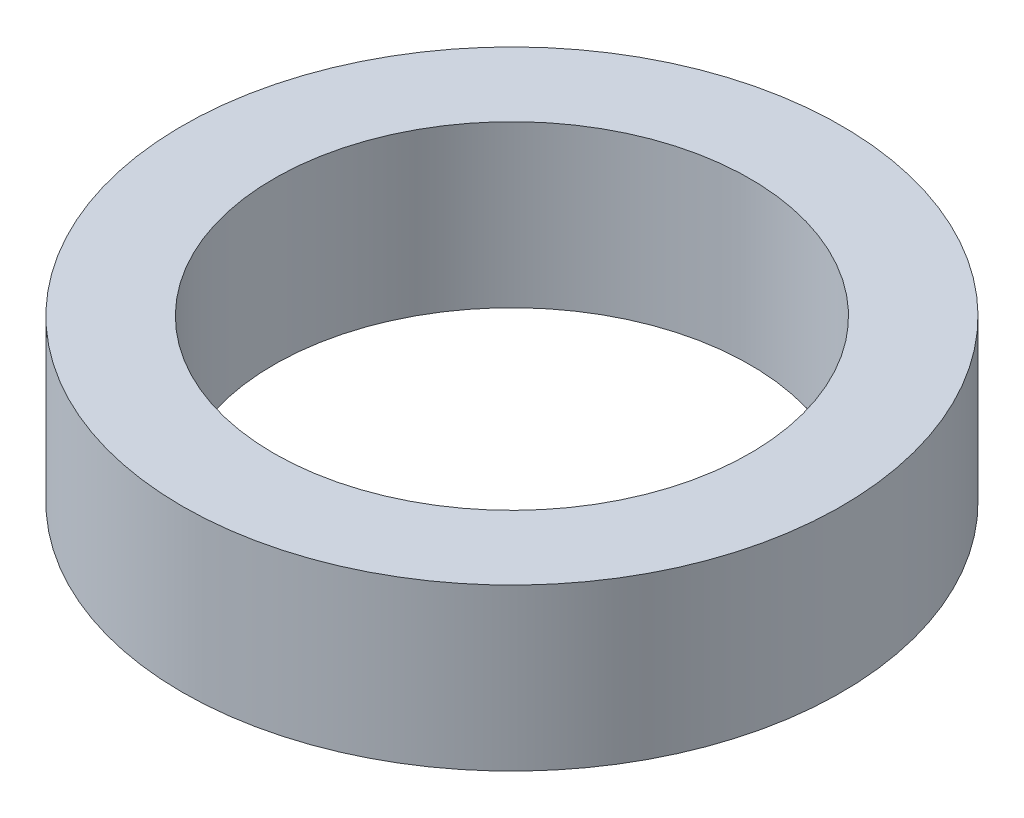
ISO-10303-21;
HEADER;
FILE_DESCRIPTION(('STEP AP214'),'2;1');
FILE_NAME('part.step','',(''),(''),'','','');
FILE_SCHEMA(('AUTOMOTIVE_DESIGN { 1 0 10303 214 1 1 1 1 }'));
ENDSEC;
DATA;
#1=APPLICATION_CONTEXT('core data for automotive mechanical design processes');
#2=APPLICATION_PROTOCOL_DEFINITION('international standard','automotive_design',2000,#1);
#3=PRODUCT_CONTEXT('',#1,'mechanical');
#4=PRODUCT('Part','Part','',(#3));
#5=PRODUCT_RELATED_PRODUCT_CATEGORY('part','',(#4));
#6=PRODUCT_DEFINITION_FORMATION('','',#4);
#7=PRODUCT_DEFINITION_CONTEXT('part definition',#1,'design');
#8=PRODUCT_DEFINITION('design','',#6,#7);
#9=PRODUCT_DEFINITION_SHAPE('','',#8);
#10=(LENGTH_UNIT() NAMED_UNIT(*) SI_UNIT(.MILLI.,.METRE.));
#11=(NAMED_UNIT(*) PLANE_ANGLE_UNIT() SI_UNIT($,.RADIAN.));
#12=(NAMED_UNIT(*) SI_UNIT($,.STERADIAN.) SOLID_ANGLE_UNIT());
#13=UNCERTAINTY_MEASURE_WITH_UNIT(LENGTH_MEASURE(1.E-05),#10,'distance_accuracy_value','');
#14=(GEOMETRIC_REPRESENTATION_CONTEXT(3) GLOBAL_UNCERTAINTY_ASSIGNED_CONTEXT((#13)) GLOBAL_UNIT_ASSIGNED_CONTEXT((#10,
#11,#12)) REPRESENTATION_CONTEXT('',''));
#15=CARTESIAN_POINT('',(0.,0.,0.));
#16=DIRECTION('',(0.,0.,1.));
#17=DIRECTION('',(1.,0.,0.));
#18=AXIS2_PLACEMENT_3D('',#15,#16,#17);
#19=CARTESIAN_POINT('',(0.,22.,0.));
#20=DIRECTION('',(0.,-1.,0.));
#21=DIRECTION('',(0.,0.,-1.));
#22=AXIS2_PLACEMENT_3D('',#19,#20,#21);
#23=CYLINDRICAL_SURFACE('',#22,45.);
#24=CARTESIAN_POINT('',(0.,22.,0.));
#25=DIRECTION('',(0.,1.,0.));
#26=DIRECTION('',(0.,0.,1.));
#27=AXIS2_PLACEMENT_3D('',#24,#25,#26);
#28=CIRCLE('',#27,45.);
#29=CARTESIAN_POINT('',(0.,22.,45.));
#30=VERTEX_POINT('',#29);
#31=EDGE_CURVE('E10',#30,#30,#28,.T.);
#32=ORIENTED_EDGE('',*,*,#31,.F.);
#33=EDGE_LOOP('',(#32));
#34=FACE_BOUND('',#33,.T.);
#35=CARTESIAN_POINT('',(0.,0.,0.));
#36=DIRECTION('',(0.,1.,0.));
#37=DIRECTION('',(0.,0.,1.));
#38=AXIS2_PLACEMENT_3D('',#35,#36,#37);
#39=CIRCLE('',#38,45.);
#40=CARTESIAN_POINT('',(0.,0.,45.));
#41=VERTEX_POINT('',#40);
#42=EDGE_CURVE('E37',#41,#41,#39,.T.);
#43=ORIENTED_EDGE('',*,*,#42,.T.);
#44=EDGE_LOOP('',(#43));
#45=FACE_BOUND('',#44,.T.);
#46=ADVANCED_FACE('F40',(#34,#45),#23,.T.);
#47=CARTESIAN_POINT('',(0.,22.,0.));
#48=DIRECTION('',(0.,1.,0.));
#49=DIRECTION('',(0.,0.,1.));
#50=AXIS2_PLACEMENT_3D('',#47,#48,#49);
#51=PLANE('',#50);
#52=CARTESIAN_POINT('',(0.,22.,0.));
#53=DIRECTION('',(0.,1.,0.));
#54=DIRECTION('',(0.,0.,1.));
#55=AXIS2_PLACEMENT_3D('',#52,#53,#54);
#56=CIRCLE('',#55,32.5);
#57=CARTESIAN_POINT('',(0.,22.,32.5));
#58=VERTEX_POINT('',#57);
#59=EDGE_CURVE('E50',#58,#58,#56,.T.);
#60=ORIENTED_EDGE('',*,*,#59,.F.);
#61=EDGE_LOOP('',(#60));
#62=FACE_BOUND('',#61,.T.);
#63=ORIENTED_EDGE('',*,*,#31,.T.);
#64=EDGE_LOOP('',(#63));
#65=FACE_BOUND('',#64,.T.);
#66=ADVANCED_FACE('F59',(#62,#65),#51,.T.);
#67=CARTESIAN_POINT('',(0.,0.,0.));
#68=DIRECTION('',(0.,1.,0.));
#69=DIRECTION('',(0.,0.,1.));
#70=AXIS2_PLACEMENT_3D('',#67,#68,#69);
#71=PLANE('',#70);
#72=CARTESIAN_POINT('',(0.,0.,0.));
#73=DIRECTION('',(0.,1.,0.));
#74=DIRECTION('',(0.,0.,1.));
#75=AXIS2_PLACEMENT_3D('',#72,#73,#74);
#76=CIRCLE('',#75,32.5);
#77=CARTESIAN_POINT('',(0.,0.,32.5));
#78=VERTEX_POINT('',#77);
#79=EDGE_CURVE('E47',#78,#78,#76,.T.);
#80=ORIENTED_EDGE('',*,*,#79,.T.);
#81=EDGE_LOOP('',(#80));
#82=FACE_BOUND('',#81,.T.);
#83=ORIENTED_EDGE('',*,*,#42,.F.);
#84=EDGE_LOOP('',(#83));
#85=FACE_BOUND('',#84,.T.);
#86=ADVANCED_FACE('F58',(#82,#85),#71,.F.);
#87=CARTESIAN_POINT('',(0.,22.,0.));
#88=DIRECTION('',(0.,-1.,0.));
#89=DIRECTION('',(0.,0.,-1.));
#90=AXIS2_PLACEMENT_3D('',#87,#88,#89);
#91=CYLINDRICAL_SURFACE('',#90,32.5);
#92=ORIENTED_EDGE('',*,*,#59,.T.);
#93=EDGE_LOOP('',(#92));
#94=FACE_BOUND('',#93,.T.);
#95=ORIENTED_EDGE('',*,*,#79,.F.);
#96=EDGE_LOOP('',(#95));
#97=FACE_BOUND('',#96,.T.);
#98=ADVANCED_FACE('F54',(#94,#97),#91,.F.);
#99=CLOSED_SHELL('',(#46,#66,#86,#98));
#100=MANIFOLD_SOLID_BREP('B2',#99);
#101=ADVANCED_BREP_SHAPE_REPRESENTATION('',(#18,#100),#14);
#102=SHAPE_DEFINITION_REPRESENTATION(#9,#101);
ENDSEC;
END-ISO-10303-21;
